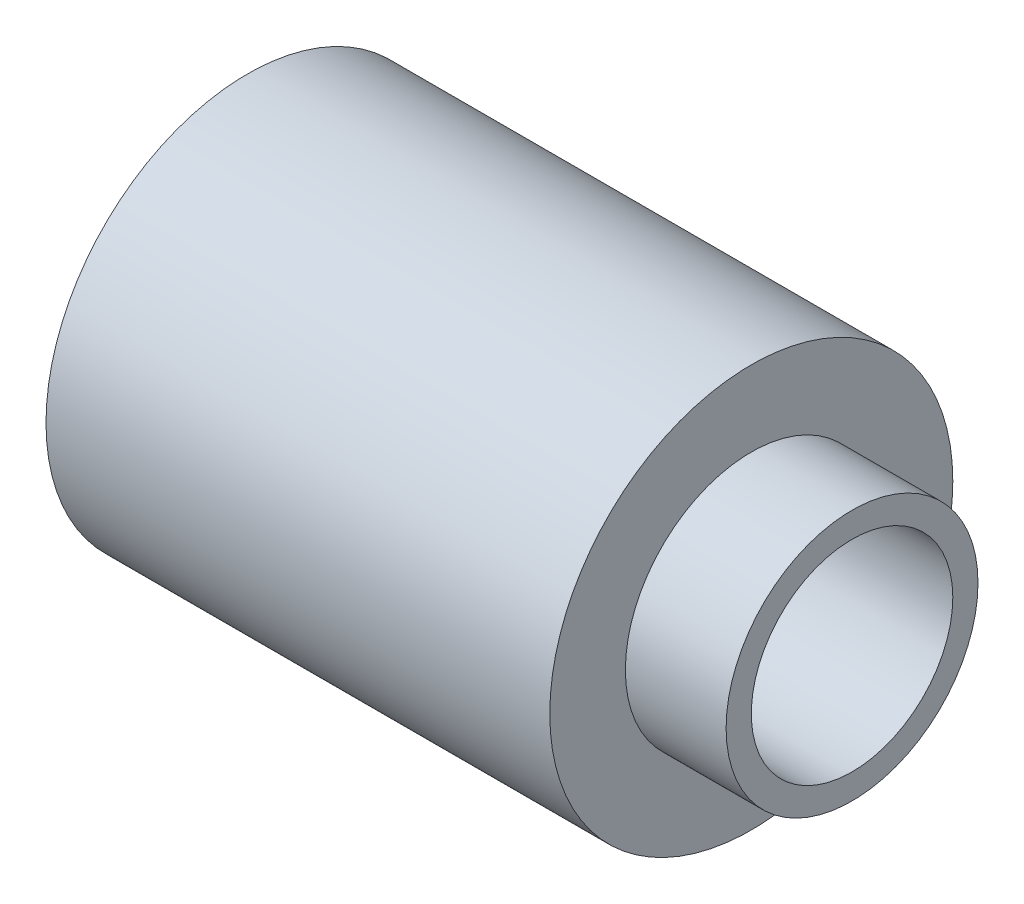
ISO-10303-21;
HEADER;
FILE_DESCRIPTION(('STEP AP214'),'2;1');
FILE_NAME('part.step','',(''),(''),'','','');
FILE_SCHEMA(('AUTOMOTIVE_DESIGN { 1 0 10303 214 1 1 1 1 }'));
ENDSEC;
DATA;
#1=APPLICATION_CONTEXT('core data for automotive mechanical design processes');
#2=APPLICATION_PROTOCOL_DEFINITION('international standard','automotive_design',2000,#1);
#3=PRODUCT_CONTEXT('',#1,'mechanical');
#4=PRODUCT('Part','Part','',(#3));
#5=PRODUCT_RELATED_PRODUCT_CATEGORY('part','',(#4));
#6=PRODUCT_DEFINITION_FORMATION('','',#4);
#7=PRODUCT_DEFINITION_CONTEXT('part definition',#1,'design');
#8=PRODUCT_DEFINITION('design','',#6,#7);
#9=PRODUCT_DEFINITION_SHAPE('','',#8);
#10=(LENGTH_UNIT() NAMED_UNIT(*) SI_UNIT(.MILLI.,.METRE.));
#11=(NAMED_UNIT(*) PLANE_ANGLE_UNIT() SI_UNIT($,.RADIAN.));
#12=(NAMED_UNIT(*) SI_UNIT($,.STERADIAN.) SOLID_ANGLE_UNIT());
#13=UNCERTAINTY_MEASURE_WITH_UNIT(LENGTH_MEASURE(1.E-05),#10,'distance_accuracy_value','');
#14=(GEOMETRIC_REPRESENTATION_CONTEXT(3) GLOBAL_UNCERTAINTY_ASSIGNED_CONTEXT((#13)) GLOBAL_UNIT_ASSIGNED_CONTEXT((#10,
#11,#12)) REPRESENTATION_CONTEXT('',''));
#15=CARTESIAN_POINT('',(0.,0.,0.));
#16=DIRECTION('',(0.,0.,1.));
#17=DIRECTION('',(1.,0.,0.));
#18=AXIS2_PLACEMENT_3D('',#15,#16,#17);
#19=CARTESIAN_POINT('',(10.,0.,0.));
#20=DIRECTION('',(1.,0.,0.));
#21=DIRECTION('',(0.,0.,-1.));
#22=AXIS2_PLACEMENT_3D('',#19,#20,#21);
#23=PLANE('',#22);
#24=CARTESIAN_POINT('',(10.,0.,0.));
#25=DIRECTION('',(1.,0.,0.));
#26=DIRECTION('',(0.,0.,-1.));
#27=AXIS2_PLACEMENT_3D('',#24,#25,#26);
#28=CIRCLE('',#27,4.);
#29=CARTESIAN_POINT('',(10.,0.,-4.));
#30=VERTEX_POINT('',#29);
#31=EDGE_CURVE('E10',#30,#30,#28,.T.);
#32=ORIENTED_EDGE('',*,*,#31,.T.);
#33=EDGE_LOOP('',(#32));
#34=FACE_BOUND('',#33,.T.);
#35=CARTESIAN_POINT('',(10.,0.,0.));
#36=DIRECTION('',(1.,0.,0.));
#37=DIRECTION('',(0.,0.,-1.));
#38=AXIS2_PLACEMENT_3D('',#35,#36,#37);
#39=CIRCLE('',#38,2.5);
#40=CARTESIAN_POINT('',(10.,0.,-2.5));
#41=VERTEX_POINT('',#40);
#42=EDGE_CURVE('E56',#41,#41,#39,.T.);
#43=ORIENTED_EDGE('',*,*,#42,.F.);
#44=EDGE_LOOP('',(#43));
#45=FACE_BOUND('',#44,.T.);
#46=ADVANCED_FACE('F37',(#34,#45),#23,.T.);
#47=CARTESIAN_POINT('',(0.,0.,0.));
#48=DIRECTION('',(1.,0.,0.));
#49=DIRECTION('',(0.,0.,-1.));
#50=AXIS2_PLACEMENT_3D('',#47,#48,#49);
#51=PLANE('',#50);
#52=CARTESIAN_POINT('',(0.,0.,0.));
#53=DIRECTION('',(1.,0.,0.));
#54=DIRECTION('',(0.,0.,-1.));
#55=AXIS2_PLACEMENT_3D('',#52,#53,#54);
#56=CIRCLE('',#55,4.);
#57=CARTESIAN_POINT('',(0.,0.,-4.));
#58=VERTEX_POINT('',#57);
#59=EDGE_CURVE('E41',#58,#58,#56,.T.);
#60=ORIENTED_EDGE('',*,*,#59,.F.);
#61=EDGE_LOOP('',(#60));
#62=FACE_BOUND('',#61,.T.);
#63=CARTESIAN_POINT('',(0.,0.,0.));
#64=DIRECTION('',(1.,0.,0.));
#65=DIRECTION('',(0.,0.,-1.));
#66=AXIS2_PLACEMENT_3D('',#63,#64,#65);
#67=CIRCLE('',#66,2.);
#68=CARTESIAN_POINT('',(0.,0.,-2.));
#69=VERTEX_POINT('',#68);
#70=EDGE_CURVE('E50',#69,#69,#67,.T.);
#71=ORIENTED_EDGE('',*,*,#70,.T.);
#72=EDGE_LOOP('',(#71));
#73=FACE_BOUND('',#72,.T.);
#74=ADVANCED_FACE('F84',(#62,#73),#51,.F.);
#75=CARTESIAN_POINT('',(10.,0.,0.));
#76=DIRECTION('',(-1.,0.,0.));
#77=DIRECTION('',(0.,0.,1.));
#78=AXIS2_PLACEMENT_3D('',#75,#76,#77);
#79=CYLINDRICAL_SURFACE('',#78,4.);
#80=ORIENTED_EDGE('',*,*,#31,.F.);
#81=EDGE_LOOP('',(#80));
#82=FACE_BOUND('',#81,.T.);
#83=ORIENTED_EDGE('',*,*,#59,.T.);
#84=EDGE_LOOP('',(#83));
#85=FACE_BOUND('',#84,.T.);
#86=ADVANCED_FACE('F39',(#82,#85),#79,.T.);
#87=CARTESIAN_POINT('',(10.,0.,0.));
#88=DIRECTION('',(-1.,0.,0.));
#89=DIRECTION('',(0.,0.,1.));
#90=AXIS2_PLACEMENT_3D('',#87,#88,#89);
#91=CYLINDRICAL_SURFACE('',#90,2.);
#92=ORIENTED_EDGE('',*,*,#70,.F.);
#93=EDGE_LOOP('',(#92));
#94=FACE_BOUND('',#93,.T.);
#95=CARTESIAN_POINT('',(12.,0.,0.));
#96=DIRECTION('',(1.,0.,0.));
#97=DIRECTION('',(0.,0.,-1.));
#98=AXIS2_PLACEMENT_3D('',#95,#96,#97);
#99=CIRCLE('',#98,2.);
#100=CARTESIAN_POINT('',(12.,0.,-2.));
#101=VERTEX_POINT('',#100);
#102=EDGE_CURVE('E60',#101,#101,#99,.T.);
#103=ORIENTED_EDGE('',*,*,#102,.T.);
#104=EDGE_LOOP('',(#103));
#105=FACE_BOUND('',#104,.T.);
#106=ADVANCED_FACE('F68',(#94,#105),#91,.F.);
#107=CARTESIAN_POINT('',(12.,0.,0.));
#108=DIRECTION('',(1.,0.,0.));
#109=DIRECTION('',(0.,0.,-1.));
#110=AXIS2_PLACEMENT_3D('',#107,#108,#109);
#111=PLANE('',#110);
#112=CARTESIAN_POINT('',(12.,0.,0.));
#113=DIRECTION('',(1.,0.,0.));
#114=DIRECTION('',(0.,0.,-1.));
#115=AXIS2_PLACEMENT_3D('',#112,#113,#114);
#116=CIRCLE('',#115,2.5);
#117=CARTESIAN_POINT('',(12.,0.,-2.5));
#118=VERTEX_POINT('',#117);
#119=EDGE_CURVE('E55',#118,#118,#116,.T.);
#120=ORIENTED_EDGE('',*,*,#119,.T.);
#121=EDGE_LOOP('',(#120));
#122=FACE_BOUND('',#121,.T.);
#123=ORIENTED_EDGE('',*,*,#102,.F.);
#124=EDGE_LOOP('',(#123));
#125=FACE_BOUND('',#124,.T.);
#126=ADVANCED_FACE('F70',(#122,#125),#111,.T.);
#127=CARTESIAN_POINT('',(12.,0.,0.));
#128=DIRECTION('',(-1.,0.,0.));
#129=DIRECTION('',(0.,0.,1.));
#130=AXIS2_PLACEMENT_3D('',#127,#128,#129);
#131=CYLINDRICAL_SURFACE('',#130,2.5);
#132=ORIENTED_EDGE('',*,*,#119,.F.);
#133=EDGE_LOOP('',(#132));
#134=FACE_BOUND('',#133,.T.);
#135=ORIENTED_EDGE('',*,*,#42,.T.);
#136=EDGE_LOOP('',(#135));
#137=FACE_BOUND('',#136,.T.);
#138=ADVANCED_FACE('F72',(#134,#137),#131,.T.);
#139=CLOSED_SHELL('',(#46,#74,#86,#106,#126,#138));
#140=MANIFOLD_SOLID_BREP('B2',#139);
#141=ADVANCED_BREP_SHAPE_REPRESENTATION('',(#18,#140),#14);
#142=SHAPE_DEFINITION_REPRESENTATION(#9,#141);
ENDSEC;
END-ISO-10303-21;
